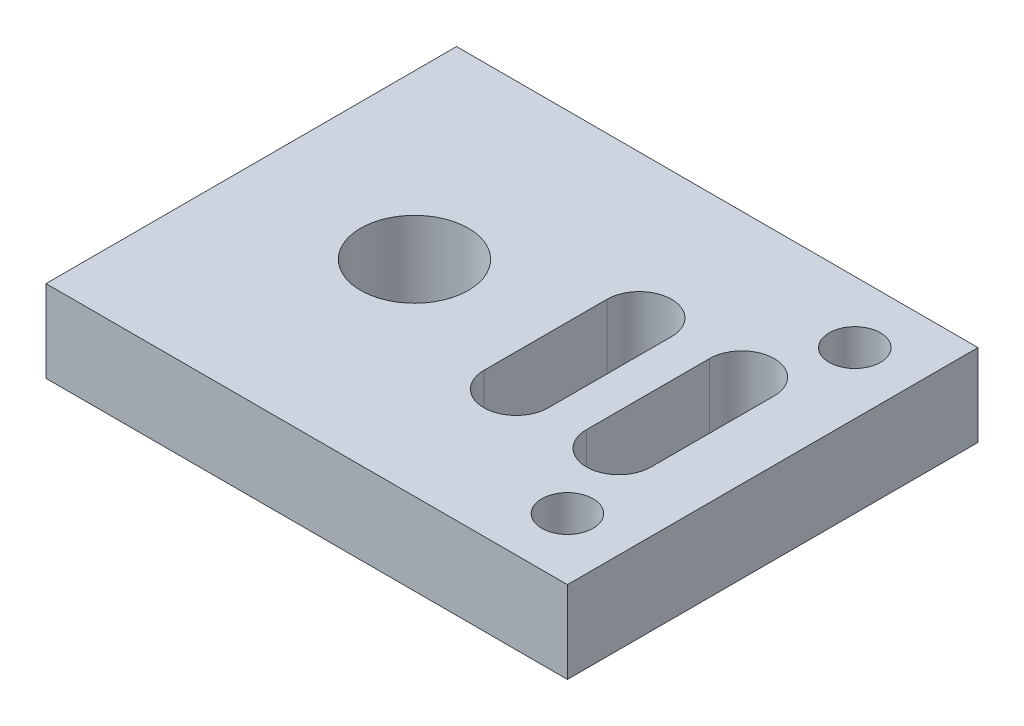
ISO-10303-21;
HEADER;
FILE_DESCRIPTION(('STEP AP214'),'2;1');
FILE_NAME('part.step','',(''),(''),'','','');
FILE_SCHEMA(('AUTOMOTIVE_DESIGN { 1 0 10303 214 1 1 1 1 }'));
ENDSEC;
DATA;
#1=APPLICATION_CONTEXT('core data for automotive mechanical design processes');
#2=APPLICATION_PROTOCOL_DEFINITION('international standard','automotive_design',2000,#1);
#3=PRODUCT_CONTEXT('',#1,'mechanical');
#4=PRODUCT('Part','Part','',(#3));
#5=PRODUCT_RELATED_PRODUCT_CATEGORY('part','',(#4));
#6=PRODUCT_DEFINITION_FORMATION('','',#4);
#7=PRODUCT_DEFINITION_CONTEXT('part definition',#1,'design');
#8=PRODUCT_DEFINITION('design','',#6,#7);
#9=PRODUCT_DEFINITION_SHAPE('','',#8);
#10=(LENGTH_UNIT() NAMED_UNIT(*) SI_UNIT(.MILLI.,.METRE.));
#11=(NAMED_UNIT(*) PLANE_ANGLE_UNIT() SI_UNIT($,.RADIAN.));
#12=(NAMED_UNIT(*) SI_UNIT($,.STERADIAN.) SOLID_ANGLE_UNIT());
#13=UNCERTAINTY_MEASURE_WITH_UNIT(LENGTH_MEASURE(1.E-05),#10,'distance_accuracy_value','');
#14=(GEOMETRIC_REPRESENTATION_CONTEXT(3) GLOBAL_UNCERTAINTY_ASSIGNED_CONTEXT((#13)) GLOBAL_UNIT_ASSIGNED_CONTEXT((#10,
#11,#12)) REPRESENTATION_CONTEXT('',''));
#15=CARTESIAN_POINT('',(0.,0.,0.));
#16=DIRECTION('',(0.,0.,1.));
#17=DIRECTION('',(1.,0.,0.));
#18=AXIS2_PLACEMENT_3D('',#15,#16,#17);
#19=CARTESIAN_POINT('',(0.,-4.,0.));
#20=DIRECTION('',(0.,0.,1.));
#21=DIRECTION('',(1.,0.,0.));
#22=AXIS2_PLACEMENT_3D('',#19,#20,#21);
#23=PLANE('',#22);
#24=DIRECTION('',(1.,0.,0.));
#25=VECTOR('',#24,1.);
#26=CARTESIAN_POINT('',(0.,0.,0.));
#27=LINE('',#26,#25);
#28=CARTESIAN_POINT('',(0.,0.,0.));
#29=VERTEX_POINT('',#28);
#30=CARTESIAN_POINT('',(25.4,0.,0.));
#31=VERTEX_POINT('',#30);
#32=EDGE_CURVE('E203',#29,#31,#27,.T.);
#33=ORIENTED_EDGE('',*,*,#32,.F.);
#34=DIRECTION('',(0.,1.,0.));
#35=VECTOR('',#34,1.);
#36=CARTESIAN_POINT('',(0.,-4.,0.));
#37=LINE('',#36,#35);
#38=CARTESIAN_POINT('',(0.,-4.,0.));
#39=VERTEX_POINT('',#38);
#40=EDGE_CURVE('E11',#39,#29,#37,.T.);
#41=ORIENTED_EDGE('',*,*,#40,.F.);
#42=DIRECTION('',(1.,0.,0.));
#43=VECTOR('',#42,1.);
#44=CARTESIAN_POINT('',(0.,-4.,0.));
#45=LINE('',#44,#43);
#46=CARTESIAN_POINT('',(25.4,-4.,0.));
#47=VERTEX_POINT('',#46);
#48=EDGE_CURVE('E206',#39,#47,#45,.T.);
#49=ORIENTED_EDGE('',*,*,#48,.T.);
#50=DIRECTION('',(0.,1.,0.));
#51=VECTOR('',#50,1.);
#52=CARTESIAN_POINT('',(25.4,-4.,0.));
#53=LINE('',#52,#51);
#54=EDGE_CURVE('E35',#47,#31,#53,.T.);
#55=ORIENTED_EDGE('',*,*,#54,.T.);
#56=EDGE_LOOP('',(#33,#41,#49,#55));
#57=FACE_BOUND('',#56,.T.);
#58=ADVANCED_FACE('F32',(#57),#23,.T.);
#59=CARTESIAN_POINT('',(0.,-4.,-20.));
#60=DIRECTION('',(-1.,0.,0.));
#61=DIRECTION('',(0.,0.,1.));
#62=AXIS2_PLACEMENT_3D('',#59,#60,#61);
#63=PLANE('',#62);
#64=DIRECTION('',(0.,0.,1.));
#65=VECTOR('',#64,1.);
#66=CARTESIAN_POINT('',(0.,0.,-20.));
#67=LINE('',#66,#65);
#68=CARTESIAN_POINT('',(0.,0.,-20.));
#69=VERTEX_POINT('',#68);
#70=EDGE_CURVE('E210',#69,#29,#67,.T.);
#71=ORIENTED_EDGE('',*,*,#70,.F.);
#72=DIRECTION('',(0.,1.,0.));
#73=VECTOR('',#72,1.);
#74=CARTESIAN_POINT('',(0.,-4.,-20.));
#75=LINE('',#74,#73);
#76=CARTESIAN_POINT('',(0.,-4.,-20.));
#77=VERTEX_POINT('',#76);
#78=EDGE_CURVE('E40',#77,#69,#75,.T.);
#79=ORIENTED_EDGE('',*,*,#78,.F.);
#80=DIRECTION('',(0.,0.,1.));
#81=VECTOR('',#80,1.);
#82=CARTESIAN_POINT('',(0.,-4.,-20.));
#83=LINE('',#82,#81);
#84=EDGE_CURVE('E216',#77,#39,#83,.T.);
#85=ORIENTED_EDGE('',*,*,#84,.T.);
#86=ORIENTED_EDGE('',*,*,#40,.T.);
#87=EDGE_LOOP('',(#71,#79,#85,#86));
#88=FACE_BOUND('',#87,.T.);
#89=ADVANCED_FACE('F242',(#88),#63,.T.);
#90=CARTESIAN_POINT('',(25.4,-4.,-20.));
#91=DIRECTION('',(0.,0.,-1.));
#92=DIRECTION('',(-1.,0.,0.));
#93=AXIS2_PLACEMENT_3D('',#90,#91,#92);
#94=PLANE('',#93);
#95=DIRECTION('',(-1.,0.,0.));
#96=VECTOR('',#95,1.);
#97=CARTESIAN_POINT('',(25.4,0.,-20.));
#98=LINE('',#97,#96);
#99=CARTESIAN_POINT('',(25.4,0.,-20.));
#100=VERTEX_POINT('',#99);
#101=EDGE_CURVE('E224',#100,#69,#98,.T.);
#102=ORIENTED_EDGE('',*,*,#101,.F.);
#103=DIRECTION('',(0.,1.,0.));
#104=VECTOR('',#103,1.);
#105=CARTESIAN_POINT('',(25.4,-4.,-20.));
#106=LINE('',#105,#104);
#107=CARTESIAN_POINT('',(25.4,-4.,-20.));
#108=VERTEX_POINT('',#107);
#109=EDGE_CURVE('E229',#108,#100,#106,.T.);
#110=ORIENTED_EDGE('',*,*,#109,.F.);
#111=DIRECTION('',(-1.,0.,0.));
#112=VECTOR('',#111,1.);
#113=CARTESIAN_POINT('',(25.4,-4.,-20.));
#114=LINE('',#113,#112);
#115=EDGE_CURVE('E213',#108,#77,#114,.T.);
#116=ORIENTED_EDGE('',*,*,#115,.T.);
#117=ORIENTED_EDGE('',*,*,#78,.T.);
#118=EDGE_LOOP('',(#102,#110,#116,#117));
#119=FACE_BOUND('',#118,.T.);
#120=ADVANCED_FACE('F247',(#119),#94,.T.);
#121=CARTESIAN_POINT('',(25.4,-4.,0.));
#122=DIRECTION('',(1.,0.,0.));
#123=DIRECTION('',(0.,0.,-1.));
#124=AXIS2_PLACEMENT_3D('',#121,#122,#123);
#125=PLANE('',#124);
#126=DIRECTION('',(0.,0.,-1.));
#127=VECTOR('',#126,1.);
#128=CARTESIAN_POINT('',(25.4,0.,0.));
#129=LINE('',#128,#127);
#130=EDGE_CURVE('E221',#31,#100,#129,.T.);
#131=ORIENTED_EDGE('',*,*,#130,.F.);
#132=ORIENTED_EDGE('',*,*,#54,.F.);
#133=DIRECTION('',(0.,0.,-1.));
#134=VECTOR('',#133,1.);
#135=CARTESIAN_POINT('',(25.4,-4.,0.));
#136=LINE('',#135,#134);
#137=EDGE_CURVE('E209',#47,#108,#136,.T.);
#138=ORIENTED_EDGE('',*,*,#137,.T.);
#139=ORIENTED_EDGE('',*,*,#109,.T.);
#140=EDGE_LOOP('',(#131,#132,#138,#139));
#141=FACE_BOUND('',#140,.T.);
#142=ADVANCED_FACE('F237',(#141),#125,.T.);
#143=CARTESIAN_POINT('',(0.,-4.,0.));
#144=DIRECTION('',(0.,1.,0.));
#145=DIRECTION('',(0.,0.,1.));
#146=AXIS2_PLACEMENT_3D('',#143,#144,#145);
#147=PLANE('',#146);
#148=CARTESIAN_POINT('',(22.4,-4.,-3.));
#149=DIRECTION('',(0.,1.,0.));
#150=DIRECTION('',(0.,0.,-1.));
#151=AXIS2_PLACEMENT_3D('',#148,#149,#150);
#152=CIRCLE('',#151,1.25);
#153=CARTESIAN_POINT('',(22.4,-4.,-4.25));
#154=VERTEX_POINT('',#153);
#155=EDGE_CURVE('E152',#154,#154,#152,.T.);
#156=ORIENTED_EDGE('',*,*,#155,.T.);
#157=EDGE_LOOP('',(#156));
#158=FACE_BOUND('',#157,.T.);
#159=DIRECTION('',(0.,0.,1.));
#160=VECTOR('',#159,1.);
#161=CARTESIAN_POINT('',(14.325,-4.,-7.));
#162=LINE('',#161,#160);
#163=CARTESIAN_POINT('',(14.325,-4.,-13.));
#164=VERTEX_POINT('',#163);
#165=CARTESIAN_POINT('',(14.325,-4.,-7.));
#166=VERTEX_POINT('',#165);
#167=EDGE_CURVE('E129',#164,#166,#162,.T.);
#168=ORIENTED_EDGE('',*,*,#167,.T.);
#169=CARTESIAN_POINT('',(15.9,-4.,-7.));
#170=DIRECTION('',(0.,1.,0.));
#171=DIRECTION('',(0.,0.,1.));
#172=AXIS2_PLACEMENT_3D('',#169,#170,#171);
#173=CIRCLE('',#172,1.575);
#174=CARTESIAN_POINT('',(17.475,-4.,-7.));
#175=VERTEX_POINT('',#174);
#176=EDGE_CURVE('E123',#166,#175,#173,.T.);
#177=ORIENTED_EDGE('',*,*,#176,.T.);
#178=DIRECTION('',(0.,0.,-1.));
#179=VECTOR('',#178,1.);
#180=CARTESIAN_POINT('',(17.475,-4.,-7.));
#181=LINE('',#180,#179);
#182=CARTESIAN_POINT('',(17.475,-4.,-13.));
#183=VERTEX_POINT('',#182);
#184=EDGE_CURVE('E132',#175,#183,#181,.T.);
#185=ORIENTED_EDGE('',*,*,#184,.T.);
#186=CARTESIAN_POINT('',(15.9,-4.,-13.));
#187=DIRECTION('',(0.,1.,0.));
#188=DIRECTION('',(0.,0.,1.));
#189=AXIS2_PLACEMENT_3D('',#186,#187,#188);
#190=CIRCLE('',#189,1.575);
#191=EDGE_CURVE('E48',#183,#164,#190,.T.);
#192=ORIENTED_EDGE('',*,*,#191,.T.);
#193=EDGE_LOOP('',(#168,#177,#185,#192));
#194=FACE_BOUND('',#193,.T.);
#195=CARTESIAN_POINT('',(7.95,-4.,-10.));
#196=DIRECTION('',(0.,1.,0.));
#197=DIRECTION('',(0.,0.,-1.));
#198=AXIS2_PLACEMENT_3D('',#195,#196,#197);
#199=CIRCLE('',#198,2.62499999999999);
#200=CARTESIAN_POINT('',(7.95,-4.,-12.625));
#201=VERTEX_POINT('',#200);
#202=EDGE_CURVE('E162',#201,#201,#199,.T.);
#203=ORIENTED_EDGE('',*,*,#202,.T.);
#204=EDGE_LOOP('',(#203));
#205=FACE_BOUND('',#204,.T.);
#206=DIRECTION('',(0.,0.,1.));
#207=VECTOR('',#206,1.);
#208=CARTESIAN_POINT('',(19.325,-4.,-7.));
#209=LINE('',#208,#207);
#210=CARTESIAN_POINT('',(19.325,-4.,-13.));
#211=VERTEX_POINT('',#210);
#212=CARTESIAN_POINT('',(19.325,-4.,-7.));
#213=VERTEX_POINT('',#212);
#214=EDGE_CURVE('E178',#211,#213,#209,.T.);
#215=ORIENTED_EDGE('',*,*,#214,.T.);
#216=CARTESIAN_POINT('',(20.9,-4.,-7.));
#217=DIRECTION('',(0.,1.,0.));
#218=DIRECTION('',(0.,0.,1.));
#219=AXIS2_PLACEMENT_3D('',#216,#217,#218);
#220=CIRCLE('',#219,1.575);
#221=CARTESIAN_POINT('',(22.475,-4.,-7.));
#222=VERTEX_POINT('',#221);
#223=EDGE_CURVE('E168',#213,#222,#220,.T.);
#224=ORIENTED_EDGE('',*,*,#223,.T.);
#225=DIRECTION('',(0.,0.,-1.));
#226=VECTOR('',#225,1.);
#227=CARTESIAN_POINT('',(22.475,-4.,-7.));
#228=LINE('',#227,#226);
#229=CARTESIAN_POINT('',(22.475,-4.,-13.));
#230=VERTEX_POINT('',#229);
#231=EDGE_CURVE('E171',#222,#230,#228,.T.);
#232=ORIENTED_EDGE('',*,*,#231,.T.);
#233=CARTESIAN_POINT('',(20.9,-4.,-13.));
#234=DIRECTION('',(0.,1.,0.));
#235=DIRECTION('',(0.,0.,1.));
#236=AXIS2_PLACEMENT_3D('',#233,#234,#235);
#237=CIRCLE('',#236,1.575);
#238=EDGE_CURVE('E175',#230,#211,#237,.T.);
#239=ORIENTED_EDGE('',*,*,#238,.T.);
#240=EDGE_LOOP('',(#215,#224,#232,#239));
#241=FACE_BOUND('',#240,.T.);
#242=CARTESIAN_POINT('',(22.4,-4.,-17.));
#243=DIRECTION('',(0.,1.,0.));
#244=DIRECTION('',(0.,0.,-1.));
#245=AXIS2_PLACEMENT_3D('',#242,#243,#244);
#246=CIRCLE('',#245,1.25);
#247=CARTESIAN_POINT('',(22.4,-4.,-18.25));
#248=VERTEX_POINT('',#247);
#249=EDGE_CURVE('E200',#248,#248,#246,.T.);
#250=ORIENTED_EDGE('',*,*,#249,.T.);
#251=EDGE_LOOP('',(#250));
#252=FACE_BOUND('',#251,.T.);
#253=ORIENTED_EDGE('',*,*,#48,.F.);
#254=ORIENTED_EDGE('',*,*,#84,.F.);
#255=ORIENTED_EDGE('',*,*,#115,.F.);
#256=ORIENTED_EDGE('',*,*,#137,.F.);
#257=EDGE_LOOP('',(#253,#254,#255,#256));
#258=FACE_BOUND('',#257,.T.);
#259=ADVANCED_FACE('F136',(#158,#194,#205,#241,#252,#258),#147,.F.);
#260=CARTESIAN_POINT('',(0.,0.,0.));
#261=DIRECTION('',(0.,1.,0.));
#262=DIRECTION('',(0.,0.,1.));
#263=AXIS2_PLACEMENT_3D('',#260,#261,#262);
#264=PLANE('',#263);
#265=CARTESIAN_POINT('',(22.4,0.,-3.));
#266=DIRECTION('',(0.,1.,0.));
#267=DIRECTION('',(0.,0.,-1.));
#268=AXIS2_PLACEMENT_3D('',#265,#266,#267);
#269=CIRCLE('',#268,1.25);
#270=CARTESIAN_POINT('',(22.4,0.,-4.25));
#271=VERTEX_POINT('',#270);
#272=EDGE_CURVE('E145',#271,#271,#269,.T.);
#273=ORIENTED_EDGE('',*,*,#272,.F.);
#274=EDGE_LOOP('',(#273));
#275=FACE_BOUND('',#274,.T.);
#276=CARTESIAN_POINT('',(15.9,0.,-7.));
#277=DIRECTION('',(0.,1.,0.));
#278=DIRECTION('',(0.,0.,1.));
#279=AXIS2_PLACEMENT_3D('',#276,#277,#278);
#280=CIRCLE('',#279,1.575);
#281=CARTESIAN_POINT('',(14.325,0.,-7.));
#282=VERTEX_POINT('',#281);
#283=CARTESIAN_POINT('',(17.475,0.,-7.));
#284=VERTEX_POINT('',#283);
#285=EDGE_CURVE('E56',#282,#284,#280,.T.);
#286=ORIENTED_EDGE('',*,*,#285,.F.);
#287=DIRECTION('',(0.,0.,1.));
#288=VECTOR('',#287,1.);
#289=CARTESIAN_POINT('',(14.325,0.,-7.));
#290=LINE('',#289,#288);
#291=CARTESIAN_POINT('',(14.325,0.,-13.));
#292=VERTEX_POINT('',#291);
#293=EDGE_CURVE('E139',#292,#282,#290,.T.);
#294=ORIENTED_EDGE('',*,*,#293,.F.);
#295=CARTESIAN_POINT('',(15.9,0.,-13.));
#296=DIRECTION('',(0.,1.,0.));
#297=DIRECTION('',(0.,0.,1.));
#298=AXIS2_PLACEMENT_3D('',#295,#296,#297);
#299=CIRCLE('',#298,1.575);
#300=CARTESIAN_POINT('',(17.475,0.,-13.));
#301=VERTEX_POINT('',#300);
#302=EDGE_CURVE('E142',#301,#292,#299,.T.);
#303=ORIENTED_EDGE('',*,*,#302,.F.);
#304=DIRECTION('',(0.,0.,-1.));
#305=VECTOR('',#304,1.);
#306=CARTESIAN_POINT('',(17.475,0.,-7.));
#307=LINE('',#306,#305);
#308=EDGE_CURVE('E151',#284,#301,#307,.T.);
#309=ORIENTED_EDGE('',*,*,#308,.F.);
#310=EDGE_LOOP('',(#286,#294,#303,#309));
#311=FACE_BOUND('',#310,.T.);
#312=CARTESIAN_POINT('',(7.95,0.,-10.));
#313=DIRECTION('',(0.,1.,0.));
#314=DIRECTION('',(0.,0.,-1.));
#315=AXIS2_PLACEMENT_3D('',#312,#313,#314);
#316=CIRCLE('',#315,2.62499999999999);
#317=CARTESIAN_POINT('',(7.95,0.,-12.625));
#318=VERTEX_POINT('',#317);
#319=EDGE_CURVE('E158',#318,#318,#316,.T.);
#320=ORIENTED_EDGE('',*,*,#319,.F.);
#321=EDGE_LOOP('',(#320));
#322=FACE_BOUND('',#321,.T.);
#323=CARTESIAN_POINT('',(20.9,0.,-7.));
#324=DIRECTION('',(0.,1.,0.));
#325=DIRECTION('',(0.,0.,1.));
#326=AXIS2_PLACEMENT_3D('',#323,#324,#325);
#327=CIRCLE('',#326,1.575);
#328=CARTESIAN_POINT('',(19.325,0.,-7.));
#329=VERTEX_POINT('',#328);
#330=CARTESIAN_POINT('',(22.475,0.,-7.));
#331=VERTEX_POINT('',#330);
#332=EDGE_CURVE('E165',#329,#331,#327,.T.);
#333=ORIENTED_EDGE('',*,*,#332,.F.);
#334=DIRECTION('',(0.,0.,1.));
#335=VECTOR('',#334,1.);
#336=CARTESIAN_POINT('',(19.325,0.,-7.));
#337=LINE('',#336,#335);
#338=CARTESIAN_POINT('',(19.325,0.,-13.));
#339=VERTEX_POINT('',#338);
#340=EDGE_CURVE('E172',#339,#329,#337,.T.);
#341=ORIENTED_EDGE('',*,*,#340,.F.);
#342=CARTESIAN_POINT('',(20.9,0.,-13.));
#343=DIRECTION('',(0.,1.,0.));
#344=DIRECTION('',(0.,0.,1.));
#345=AXIS2_PLACEMENT_3D('',#342,#343,#344);
#346=CIRCLE('',#345,1.575);
#347=CARTESIAN_POINT('',(22.475,0.,-13.));
#348=VERTEX_POINT('',#347);
#349=EDGE_CURVE('E186',#348,#339,#346,.T.);
#350=ORIENTED_EDGE('',*,*,#349,.F.);
#351=DIRECTION('',(0.,0.,-1.));
#352=VECTOR('',#351,1.);
#353=CARTESIAN_POINT('',(22.475,0.,-7.));
#354=LINE('',#353,#352);
#355=EDGE_CURVE('E183',#331,#348,#354,.T.);
#356=ORIENTED_EDGE('',*,*,#355,.F.);
#357=EDGE_LOOP('',(#333,#341,#350,#356));
#358=FACE_BOUND('',#357,.T.);
#359=CARTESIAN_POINT('',(22.4,0.,-17.));
#360=DIRECTION('',(0.,1.,0.));
#361=DIRECTION('',(0.,0.,-1.));
#362=AXIS2_PLACEMENT_3D('',#359,#360,#361);
#363=CIRCLE('',#362,1.25);
#364=CARTESIAN_POINT('',(22.4,0.,-18.25));
#365=VERTEX_POINT('',#364);
#366=EDGE_CURVE('E193',#365,#365,#363,.T.);
#367=ORIENTED_EDGE('',*,*,#366,.F.);
#368=EDGE_LOOP('',(#367));
#369=FACE_BOUND('',#368,.T.);
#370=ORIENTED_EDGE('',*,*,#32,.T.);
#371=ORIENTED_EDGE('',*,*,#130,.T.);
#372=ORIENTED_EDGE('',*,*,#101,.T.);
#373=ORIENTED_EDGE('',*,*,#70,.T.);
#374=EDGE_LOOP('',(#370,#371,#372,#373));
#375=FACE_BOUND('',#374,.T.);
#376=ADVANCED_FACE('F239',(#275,#311,#322,#358,#369,#375),#264,.T.);
#377=CARTESIAN_POINT('',(22.4,-4.,-17.));
#378=DIRECTION('',(0.,1.,0.));
#379=DIRECTION('',(0.,0.,1.));
#380=AXIS2_PLACEMENT_3D('',#377,#378,#379);
#381=CYLINDRICAL_SURFACE('',#380,1.25);
#382=ORIENTED_EDGE('',*,*,#249,.F.);
#383=EDGE_LOOP('',(#382));
#384=FACE_BOUND('',#383,.T.);
#385=ORIENTED_EDGE('',*,*,#366,.T.);
#386=EDGE_LOOP('',(#385));
#387=FACE_BOUND('',#386,.T.);
#388=ADVANCED_FACE('F290',(#384,#387),#381,.F.);
#389=CARTESIAN_POINT('',(20.9,-4.,-7.));
#390=DIRECTION('',(0.,1.,0.));
#391=DIRECTION('',(0.,0.,1.));
#392=AXIS2_PLACEMENT_3D('',#389,#390,#391);
#393=CYLINDRICAL_SURFACE('',#392,1.575);
#394=ORIENTED_EDGE('',*,*,#332,.T.);
#395=DIRECTION('',(0.,1.,0.));
#396=VECTOR('',#395,1.);
#397=CARTESIAN_POINT('',(22.475,-4.,-7.));
#398=LINE('',#397,#396);
#399=EDGE_CURVE('E181',#222,#331,#398,.T.);
#400=ORIENTED_EDGE('',*,*,#399,.F.);
#401=ORIENTED_EDGE('',*,*,#223,.F.);
#402=DIRECTION('',(0.,1.,0.));
#403=VECTOR('',#402,1.);
#404=CARTESIAN_POINT('',(19.325,-4.,-7.));
#405=LINE('',#404,#403);
#406=EDGE_CURVE('E191',#213,#329,#405,.T.);
#407=ORIENTED_EDGE('',*,*,#406,.T.);
#408=EDGE_LOOP('',(#394,#400,#401,#407));
#409=FACE_BOUND('',#408,.T.);
#410=ADVANCED_FACE('F300',(#409),#393,.F.);
#411=CARTESIAN_POINT('',(19.325,-4.,-7.));
#412=DIRECTION('',(-1.,0.,0.));
#413=DIRECTION('',(0.,0.,1.));
#414=AXIS2_PLACEMENT_3D('',#411,#412,#413);
#415=PLANE('',#414);
#416=ORIENTED_EDGE('',*,*,#340,.T.);
#417=ORIENTED_EDGE('',*,*,#406,.F.);
#418=ORIENTED_EDGE('',*,*,#214,.F.);
#419=DIRECTION('',(0.,1.,0.));
#420=VECTOR('',#419,1.);
#421=CARTESIAN_POINT('',(19.325,-4.,-13.));
#422=LINE('',#421,#420);
#423=EDGE_CURVE('E194',#211,#339,#422,.T.);
#424=ORIENTED_EDGE('',*,*,#423,.T.);
#425=EDGE_LOOP('',(#416,#417,#418,#424));
#426=FACE_BOUND('',#425,.T.);
#427=ADVANCED_FACE('F310',(#426),#415,.F.);
#428=CARTESIAN_POINT('',(20.9,-4.,-13.));
#429=DIRECTION('',(0.,1.,0.));
#430=DIRECTION('',(0.,0.,1.));
#431=AXIS2_PLACEMENT_3D('',#428,#429,#430);
#432=CYLINDRICAL_SURFACE('',#431,1.575);
#433=ORIENTED_EDGE('',*,*,#349,.T.);
#434=ORIENTED_EDGE('',*,*,#423,.F.);
#435=ORIENTED_EDGE('',*,*,#238,.F.);
#436=DIRECTION('',(0.,1.,0.));
#437=VECTOR('',#436,1.);
#438=CARTESIAN_POINT('',(22.475,-4.,-13.));
#439=LINE('',#438,#437);
#440=EDGE_CURVE('E196',#230,#348,#439,.T.);
#441=ORIENTED_EDGE('',*,*,#440,.T.);
#442=EDGE_LOOP('',(#433,#434,#435,#441));
#443=FACE_BOUND('',#442,.T.);
#444=ADVANCED_FACE('F320',(#443),#432,.F.);
#445=CARTESIAN_POINT('',(22.475,-4.,-7.));
#446=DIRECTION('',(1.,0.,0.));
#447=DIRECTION('',(0.,0.,-1.));
#448=AXIS2_PLACEMENT_3D('',#445,#446,#447);
#449=PLANE('',#448);
#450=ORIENTED_EDGE('',*,*,#355,.T.);
#451=ORIENTED_EDGE('',*,*,#440,.F.);
#452=ORIENTED_EDGE('',*,*,#231,.F.);
#453=ORIENTED_EDGE('',*,*,#399,.T.);
#454=EDGE_LOOP('',(#450,#451,#452,#453));
#455=FACE_BOUND('',#454,.T.);
#456=ADVANCED_FACE('F330',(#455),#449,.F.);
#457=CARTESIAN_POINT('',(7.95,-4.,-10.));
#458=DIRECTION('',(0.,1.,0.));
#459=DIRECTION('',(0.,0.,1.));
#460=AXIS2_PLACEMENT_3D('',#457,#458,#459);
#461=CYLINDRICAL_SURFACE('',#460,2.62499999999999);
#462=ORIENTED_EDGE('',*,*,#202,.F.);
#463=EDGE_LOOP('',(#462));
#464=FACE_BOUND('',#463,.T.);
#465=ORIENTED_EDGE('',*,*,#319,.T.);
#466=EDGE_LOOP('',(#465));
#467=FACE_BOUND('',#466,.T.);
#468=ADVANCED_FACE('F340',(#464,#467),#461,.F.);
#469=CARTESIAN_POINT('',(15.9,-4.,-7.));
#470=DIRECTION('',(0.,1.,0.));
#471=DIRECTION('',(0.,0.,1.));
#472=AXIS2_PLACEMENT_3D('',#469,#470,#471);
#473=CYLINDRICAL_SURFACE('',#472,1.575);
#474=ORIENTED_EDGE('',*,*,#285,.T.);
#475=DIRECTION('',(0.,1.,0.));
#476=VECTOR('',#475,1.);
#477=CARTESIAN_POINT('',(17.475,-4.,-7.));
#478=LINE('',#477,#476);
#479=EDGE_CURVE('E119',#175,#284,#478,.T.);
#480=ORIENTED_EDGE('',*,*,#479,.F.);
#481=ORIENTED_EDGE('',*,*,#176,.F.);
#482=DIRECTION('',(0.,1.,0.));
#483=VECTOR('',#482,1.);
#484=CARTESIAN_POINT('',(14.325,-4.,-7.));
#485=LINE('',#484,#483);
#486=EDGE_CURVE('E156',#166,#282,#485,.T.);
#487=ORIENTED_EDGE('',*,*,#486,.T.);
#488=EDGE_LOOP('',(#474,#480,#481,#487));
#489=FACE_BOUND('',#488,.T.);
#490=ADVANCED_FACE('F121',(#489),#473,.F.);
#491=CARTESIAN_POINT('',(14.325,-4.,-7.));
#492=DIRECTION('',(-1.,0.,0.));
#493=DIRECTION('',(0.,0.,1.));
#494=AXIS2_PLACEMENT_3D('',#491,#492,#493);
#495=PLANE('',#494);
#496=ORIENTED_EDGE('',*,*,#293,.T.);
#497=ORIENTED_EDGE('',*,*,#486,.F.);
#498=ORIENTED_EDGE('',*,*,#167,.F.);
#499=DIRECTION('',(0.,1.,0.));
#500=VECTOR('',#499,1.);
#501=CARTESIAN_POINT('',(14.325,-4.,-13.));
#502=LINE('',#501,#500);
#503=EDGE_CURVE('E159',#164,#292,#502,.T.);
#504=ORIENTED_EDGE('',*,*,#503,.T.);
#505=EDGE_LOOP('',(#496,#497,#498,#504));
#506=FACE_BOUND('',#505,.T.);
#507=ADVANCED_FACE('F359',(#506),#495,.F.);
#508=CARTESIAN_POINT('',(15.9,-4.,-13.));
#509=DIRECTION('',(0.,1.,0.));
#510=DIRECTION('',(0.,0.,1.));
#511=AXIS2_PLACEMENT_3D('',#508,#509,#510);
#512=CYLINDRICAL_SURFACE('',#511,1.575);
#513=ORIENTED_EDGE('',*,*,#302,.T.);
#514=ORIENTED_EDGE('',*,*,#503,.F.);
#515=ORIENTED_EDGE('',*,*,#191,.F.);
#516=DIRECTION('',(0.,1.,0.));
#517=VECTOR('',#516,1.);
#518=CARTESIAN_POINT('',(17.475,-4.,-13.));
#519=LINE('',#518,#517);
#520=EDGE_CURVE('E128',#183,#301,#519,.T.);
#521=ORIENTED_EDGE('',*,*,#520,.T.);
#522=EDGE_LOOP('',(#513,#514,#515,#521));
#523=FACE_BOUND('',#522,.T.);
#524=ADVANCED_FACE('F368',(#523),#512,.F.);
#525=CARTESIAN_POINT('',(17.475,-4.,-7.));
#526=DIRECTION('',(1.,0.,0.));
#527=DIRECTION('',(0.,0.,-1.));
#528=AXIS2_PLACEMENT_3D('',#525,#526,#527);
#529=PLANE('',#528);
#530=ORIENTED_EDGE('',*,*,#308,.T.);
#531=ORIENTED_EDGE('',*,*,#520,.F.);
#532=ORIENTED_EDGE('',*,*,#184,.F.);
#533=ORIENTED_EDGE('',*,*,#479,.T.);
#534=EDGE_LOOP('',(#530,#531,#532,#533));
#535=FACE_BOUND('',#534,.T.);
#536=ADVANCED_FACE('F133',(#535),#529,.F.);
#537=CARTESIAN_POINT('',(22.4,-4.,-3.));
#538=DIRECTION('',(0.,1.,0.));
#539=DIRECTION('',(0.,0.,1.));
#540=AXIS2_PLACEMENT_3D('',#537,#538,#539);
#541=CYLINDRICAL_SURFACE('',#540,1.25);
#542=ORIENTED_EDGE('',*,*,#155,.F.);
#543=EDGE_LOOP('',(#542));
#544=FACE_BOUND('',#543,.T.);
#545=ORIENTED_EDGE('',*,*,#272,.T.);
#546=EDGE_LOOP('',(#545));
#547=FACE_BOUND('',#546,.T.);
#548=ADVANCED_FACE('F386',(#544,#547),#541,.F.);
#549=CLOSED_SHELL('',(#58,#89,#120,#142,#259,#376,#388,#410,#427,#444,#456,#468,#490,#507,#524,
#536,#548));
#550=MANIFOLD_SOLID_BREP('B2',#549);
#551=ADVANCED_BREP_SHAPE_REPRESENTATION('',(#18,#550),#14);
#552=SHAPE_DEFINITION_REPRESENTATION(#9,#551);
ENDSEC;
END-ISO-10303-21;
